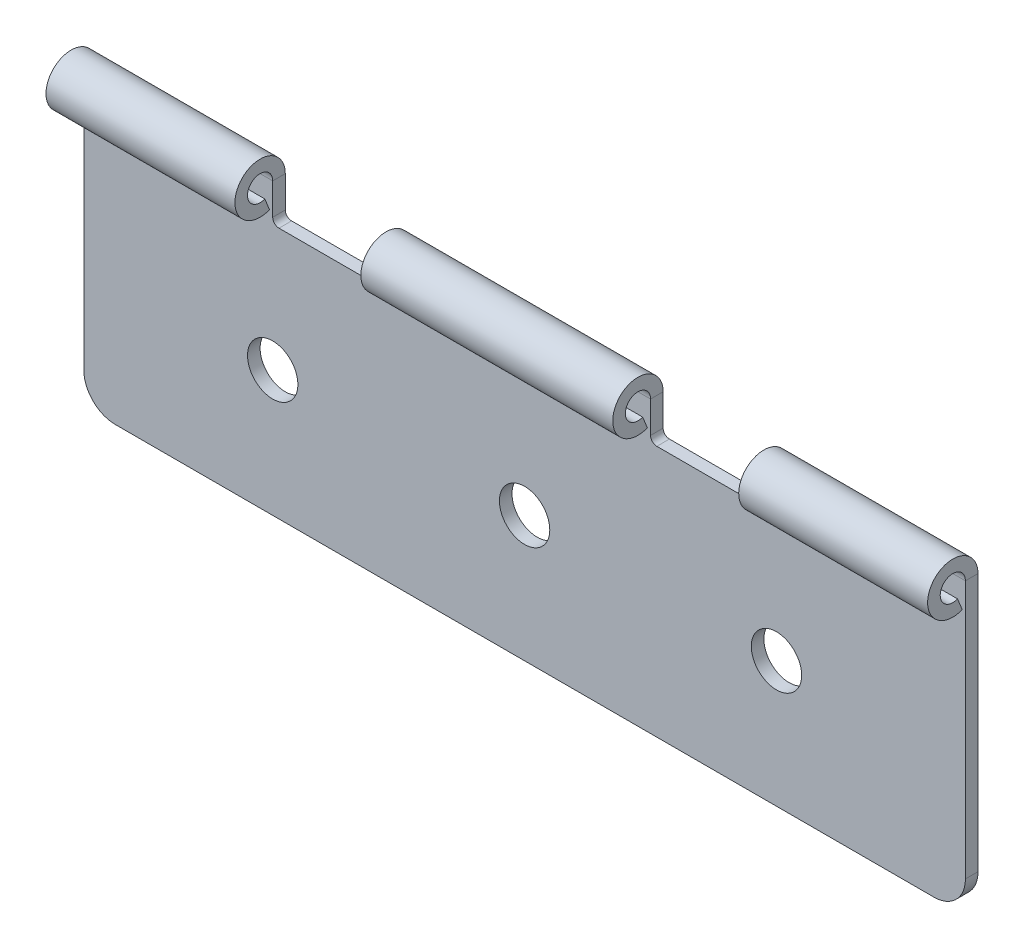
ISO-10303-21;
HEADER;
FILE_DESCRIPTION(('STEP AP214'),'2;1');
FILE_NAME('part.step','',(''),(''),'','','');
FILE_SCHEMA(('AUTOMOTIVE_DESIGN { 1 0 10303 214 1 1 1 1 }'));
ENDSEC;
DATA;
#1=APPLICATION_CONTEXT('core data for automotive mechanical design processes');
#2=APPLICATION_PROTOCOL_DEFINITION('international standard','automotive_design',2000,#1);
#3=PRODUCT_CONTEXT('',#1,'mechanical');
#4=PRODUCT('Part','Part','',(#3));
#5=PRODUCT_RELATED_PRODUCT_CATEGORY('part','',(#4));
#6=PRODUCT_DEFINITION_FORMATION('','',#4);
#7=PRODUCT_DEFINITION_CONTEXT('part definition',#1,'design');
#8=PRODUCT_DEFINITION('design','',#6,#7);
#9=PRODUCT_DEFINITION_SHAPE('','',#8);
#10=(LENGTH_UNIT() NAMED_UNIT(*) SI_UNIT(.MILLI.,.METRE.));
#11=(NAMED_UNIT(*) PLANE_ANGLE_UNIT() SI_UNIT($,.RADIAN.));
#12=(NAMED_UNIT(*) SI_UNIT($,.STERADIAN.) SOLID_ANGLE_UNIT());
#13=UNCERTAINTY_MEASURE_WITH_UNIT(LENGTH_MEASURE(1.E-05),#10,'distance_accuracy_value','');
#14=(GEOMETRIC_REPRESENTATION_CONTEXT(3) GLOBAL_UNCERTAINTY_ASSIGNED_CONTEXT((#13)) GLOBAL_UNIT_ASSIGNED_CONTEXT((#10,
#11,#12)) REPRESENTATION_CONTEXT('',''));
#15=CARTESIAN_POINT('',(0.,0.,0.));
#16=DIRECTION('',(0.,0.,1.));
#17=DIRECTION('',(1.,0.,0.));
#18=AXIS2_PLACEMENT_3D('',#15,#16,#17);
#19=CARTESIAN_POINT('',(110.,40.,-2.));
#20=DIRECTION('',(-1.,0.,0.));
#21=DIRECTION('',(0.,0.,1.));
#22=AXIS2_PLACEMENT_3D('',#19,#20,#21);
#23=PLANE('',#22);
#24=DIRECTION('',(0.,-1.,0.));
#25=VECTOR('',#24,1.);
#26=CARTESIAN_POINT('',(110.,40.,-2.));
#27=LINE('',#26,#25);
#28=CARTESIAN_POINT('',(110.,46.,-2.00000000000001));
#29=VERTEX_POINT('',#28);
#30=CARTESIAN_POINT('',(110.,41.,-2.));
#31=VERTEX_POINT('',#30);
#32=EDGE_CURVE('E206',#29,#31,#27,.T.);
#33=ORIENTED_EDGE('',*,*,#32,.T.);
#34=DIRECTION('',(0.,0.,1.));
#35=VECTOR('',#34,1.);
#36=CARTESIAN_POINT('',(110.,41.,0.));
#37=LINE('',#36,#35);
#38=CARTESIAN_POINT('',(110.,41.,0.));
#39=VERTEX_POINT('',#38);
#40=EDGE_CURVE('E341',#31,#39,#37,.T.);
#41=ORIENTED_EDGE('',*,*,#40,.T.);
#42=DIRECTION('',(0.,-1.,0.));
#43=VECTOR('',#42,1.);
#44=CARTESIAN_POINT('',(110.,40.,0.));
#45=LINE('',#44,#43);
#46=CARTESIAN_POINT('',(110.,46.,0.));
#47=VERTEX_POINT('',#46);
#48=EDGE_CURVE('E346',#47,#39,#45,.T.);
#49=ORIENTED_EDGE('',*,*,#48,.F.);
#50=DIRECTION('',(0.,0.,-1.));
#51=VECTOR('',#50,1.);
#52=CARTESIAN_POINT('',(110.,46.,0.));
#53=LINE('',#52,#51);
#54=EDGE_CURVE('E218',#47,#29,#53,.T.);
#55=ORIENTED_EDGE('',*,*,#54,.T.);
#56=EDGE_LOOP('',(#33,#41,#49,#55));
#57=FACE_BOUND('',#56,.T.);
#58=ADVANCED_FACE('F38',(#57),#23,.T.);
#59=CARTESIAN_POINT('',(50.,40.,-2.));
#60=DIRECTION('',(-1.,0.,0.));
#61=DIRECTION('',(0.,-1.,0.));
#62=AXIS2_PLACEMENT_3D('',#59,#60,#61);
#63=PLANE('',#62);
#64=DIRECTION('',(0.,-1.,0.));
#65=VECTOR('',#64,1.);
#66=CARTESIAN_POINT('',(50.,40.,-2.));
#67=LINE('',#66,#65);
#68=CARTESIAN_POINT('',(50.,46.,-2.));
#69=VERTEX_POINT('',#68);
#70=CARTESIAN_POINT('',(50.,41.,-2.));
#71=VERTEX_POINT('',#70);
#72=EDGE_CURVE('E331',#69,#71,#67,.T.);
#73=ORIENTED_EDGE('',*,*,#72,.T.);
#74=DIRECTION('',(0.,0.,1.));
#75=VECTOR('',#74,1.);
#76=CARTESIAN_POINT('',(50.,41.,0.));
#77=LINE('',#76,#75);
#78=CARTESIAN_POINT('',(50.,41.,0.));
#79=VERTEX_POINT('',#78);
#80=EDGE_CURVE('E373',#71,#79,#77,.T.);
#81=ORIENTED_EDGE('',*,*,#80,.T.);
#82=DIRECTION('',(0.,-1.,0.));
#83=VECTOR('',#82,1.);
#84=CARTESIAN_POINT('',(50.,40.,0.));
#85=LINE('',#84,#83);
#86=CARTESIAN_POINT('',(50.,46.,0.));
#87=VERTEX_POINT('',#86);
#88=EDGE_CURVE('E354',#87,#79,#85,.T.);
#89=ORIENTED_EDGE('',*,*,#88,.F.);
#90=DIRECTION('',(0.,0.,-1.));
#91=VECTOR('',#90,1.);
#92=CARTESIAN_POINT('',(50.,46.,0.));
#93=LINE('',#92,#91);
#94=EDGE_CURVE('E263',#87,#69,#93,.T.);
#95=ORIENTED_EDGE('',*,*,#94,.T.);
#96=EDGE_LOOP('',(#73,#81,#89,#95));
#97=FACE_BOUND('',#96,.T.);
#98=ADVANCED_FACE('F456',(#97),#63,.T.);
#99=CARTESIAN_POINT('',(0.,0.,-2.));
#100=DIRECTION('',(-1.,0.,0.));
#101=DIRECTION('',(0.,0.,1.));
#102=AXIS2_PLACEMENT_3D('',#99,#100,#101);
#103=PLANE('',#102);
#104=DIRECTION('',(0.,-1.,0.));
#105=VECTOR('',#104,1.);
#106=CARTESIAN_POINT('',(0.,0.,-2.));
#107=LINE('',#106,#105);
#108=CARTESIAN_POINT('',(0.,46.,-2.00000000000001));
#109=VERTEX_POINT('',#108);
#110=CARTESIAN_POINT('',(0.,5.,-2.));
#111=VERTEX_POINT('',#110);
#112=EDGE_CURVE('E339',#109,#111,#107,.T.);
#113=ORIENTED_EDGE('',*,*,#112,.T.);
#114=DIRECTION('',(0.,0.,1.));
#115=VECTOR('',#114,1.);
#116=CARTESIAN_POINT('',(0.,5.,-2.));
#117=LINE('',#116,#115);
#118=CARTESIAN_POINT('',(0.,5.,0.));
#119=VERTEX_POINT('',#118);
#120=EDGE_CURVE('E11',#111,#119,#117,.T.);
#121=ORIENTED_EDGE('',*,*,#120,.T.);
#122=DIRECTION('',(0.,-1.,0.));
#123=VECTOR('',#122,1.);
#124=CARTESIAN_POINT('',(0.,0.,0.));
#125=LINE('',#124,#123);
#126=CARTESIAN_POINT('',(0.,46.,0.));
#127=VERTEX_POINT('',#126);
#128=EDGE_CURVE('E323',#127,#119,#125,.T.);
#129=ORIENTED_EDGE('',*,*,#128,.F.);
#130=DIRECTION('',(0.,0.,-1.));
#131=VECTOR('',#130,1.);
#132=CARTESIAN_POINT('',(0.,46.,0.));
#133=LINE('',#132,#131);
#134=EDGE_CURVE('E296',#127,#109,#133,.T.);
#135=ORIENTED_EDGE('',*,*,#134,.T.);
#136=EDGE_LOOP('',(#113,#121,#129,#135));
#137=FACE_BOUND('',#136,.T.);
#138=ADVANCED_FACE('F423',(#137),#103,.T.);
#139=CARTESIAN_POINT('',(140.,0.,-2.));
#140=DIRECTION('',(0.,-1.,0.));
#141=DIRECTION('',(1.,0.,0.));
#142=AXIS2_PLACEMENT_3D('',#139,#140,#141);
#143=PLANE('',#142);
#144=DIRECTION('',(1.,0.,0.));
#145=VECTOR('',#144,1.);
#146=CARTESIAN_POINT('',(140.,0.,-2.));
#147=LINE('',#146,#145);
#148=CARTESIAN_POINT('',(5.,0.,-2.));
#149=VERTEX_POINT('',#148);
#150=CARTESIAN_POINT('',(135.,0.,-2.));
#151=VERTEX_POINT('',#150);
#152=EDGE_CURVE('E207',#149,#151,#147,.T.);
#153=ORIENTED_EDGE('',*,*,#152,.T.);
#154=DIRECTION('',(0.,0.,1.));
#155=VECTOR('',#154,1.);
#156=CARTESIAN_POINT('',(135.,0.,-2.));
#157=LINE('',#156,#155);
#158=CARTESIAN_POINT('',(135.,0.,0.));
#159=VERTEX_POINT('',#158);
#160=EDGE_CURVE('E401',#151,#159,#157,.T.);
#161=ORIENTED_EDGE('',*,*,#160,.T.);
#162=DIRECTION('',(1.,0.,0.));
#163=VECTOR('',#162,1.);
#164=CARTESIAN_POINT('',(140.,0.,0.));
#165=LINE('',#164,#163);
#166=CARTESIAN_POINT('',(5.,0.,0.));
#167=VERTEX_POINT('',#166);
#168=EDGE_CURVE('E319',#167,#159,#165,.T.);
#169=ORIENTED_EDGE('',*,*,#168,.F.);
#170=DIRECTION('',(0.,0.,1.));
#171=VECTOR('',#170,1.);
#172=CARTESIAN_POINT('',(5.,0.,-2.));
#173=LINE('',#172,#171);
#174=EDGE_CURVE('E399',#167,#149,#173,.F.);
#175=ORIENTED_EDGE('',*,*,#174,.T.);
#176=EDGE_LOOP('',(#153,#161,#169,#175));
#177=FACE_BOUND('',#176,.T.);
#178=ADVANCED_FACE('F412',(#177),#143,.T.);
#179=CARTESIAN_POINT('',(30.,50.,-2.));
#180=DIRECTION('',(1.,0.,0.));
#181=DIRECTION('',(0.,1.,0.));
#182=AXIS2_PLACEMENT_3D('',#179,#180,#181);
#183=PLANE('',#182);
#184=DIRECTION('',(0.,1.,0.));
#185=VECTOR('',#184,1.);
#186=CARTESIAN_POINT('',(30.,50.,0.));
#187=LINE('',#186,#185);
#188=CARTESIAN_POINT('',(30.,41.,0.));
#189=VERTEX_POINT('',#188);
#190=CARTESIAN_POINT('',(30.,46.,0.));
#191=VERTEX_POINT('',#190);
#192=EDGE_CURVE('E360',#189,#191,#187,.T.);
#193=ORIENTED_EDGE('',*,*,#192,.F.);
#194=DIRECTION('',(0.,0.,1.));
#195=VECTOR('',#194,1.);
#196=CARTESIAN_POINT('',(30.,41.,-2.));
#197=LINE('',#196,#195);
#198=CARTESIAN_POINT('',(30.,41.,-2.));
#199=VERTEX_POINT('',#198);
#200=EDGE_CURVE('E381',#189,#199,#197,.F.);
#201=ORIENTED_EDGE('',*,*,#200,.T.);
#202=DIRECTION('',(0.,1.,0.));
#203=VECTOR('',#202,1.);
#204=CARTESIAN_POINT('',(30.,50.,-2.));
#205=LINE('',#204,#203);
#206=CARTESIAN_POINT('',(30.,46.,-2.));
#207=VERTEX_POINT('',#206);
#208=EDGE_CURVE('E337',#199,#207,#205,.T.);
#209=ORIENTED_EDGE('',*,*,#208,.T.);
#210=DIRECTION('',(0.,0.,-1.));
#211=VECTOR('',#210,1.);
#212=CARTESIAN_POINT('',(30.,46.,0.));
#213=LINE('',#212,#211);
#214=EDGE_CURVE('E312',#191,#207,#213,.T.);
#215=ORIENTED_EDGE('',*,*,#214,.F.);
#216=EDGE_LOOP('',(#193,#201,#209,#215));
#217=FACE_BOUND('',#216,.T.);
#218=ADVANCED_FACE('F437',(#217),#183,.T.);
#219=CARTESIAN_POINT('',(30.,40.,-2.));
#220=DIRECTION('',(0.,1.,0.));
#221=DIRECTION('',(0.,0.,1.));
#222=AXIS2_PLACEMENT_3D('',#219,#220,#221);
#223=PLANE('',#222);
#224=DIRECTION('',(-1.,0.,0.));
#225=VECTOR('',#224,1.);
#226=CARTESIAN_POINT('',(30.,40.,0.));
#227=LINE('',#226,#225);
#228=CARTESIAN_POINT('',(49.,40.,0.));
#229=VERTEX_POINT('',#228);
#230=CARTESIAN_POINT('',(31.,40.,0.));
#231=VERTEX_POINT('',#230);
#232=EDGE_CURVE('E357',#229,#231,#227,.T.);
#233=ORIENTED_EDGE('',*,*,#232,.F.);
#234=DIRECTION('',(0.,0.,1.));
#235=VECTOR('',#234,1.);
#236=CARTESIAN_POINT('',(49.,40.,-2.));
#237=LINE('',#236,#235);
#238=CARTESIAN_POINT('',(49.,40.,-2.));
#239=VERTEX_POINT('',#238);
#240=EDGE_CURVE('E379',#229,#239,#237,.F.);
#241=ORIENTED_EDGE('',*,*,#240,.T.);
#242=DIRECTION('',(-1.,0.,0.));
#243=VECTOR('',#242,1.);
#244=CARTESIAN_POINT('',(30.,40.,-2.));
#245=LINE('',#244,#243);
#246=CARTESIAN_POINT('',(31.,40.,-2.));
#247=VERTEX_POINT('',#246);
#248=EDGE_CURVE('E334',#239,#247,#245,.T.);
#249=ORIENTED_EDGE('',*,*,#248,.T.);
#250=DIRECTION('',(0.,0.,1.));
#251=VECTOR('',#250,1.);
#252=CARTESIAN_POINT('',(31.,40.,0.));
#253=LINE('',#252,#251);
#254=EDGE_CURVE('E376',#247,#231,#253,.T.);
#255=ORIENTED_EDGE('',*,*,#254,.T.);
#256=EDGE_LOOP('',(#233,#241,#249,#255));
#257=FACE_BOUND('',#256,.T.);
#258=ADVANCED_FACE('F447',(#257),#223,.T.);
#259=CARTESIAN_POINT('',(90.,50.,-2.));
#260=DIRECTION('',(1.,0.,0.));
#261=DIRECTION('',(0.,1.,0.));
#262=AXIS2_PLACEMENT_3D('',#259,#260,#261);
#263=PLANE('',#262);
#264=DIRECTION('',(0.,1.,0.));
#265=VECTOR('',#264,1.);
#266=CARTESIAN_POINT('',(90.,50.,0.));
#267=LINE('',#266,#265);
#268=CARTESIAN_POINT('',(90.,41.,0.));
#269=VERTEX_POINT('',#268);
#270=CARTESIAN_POINT('',(90.,46.,0.));
#271=VERTEX_POINT('',#270);
#272=EDGE_CURVE('E352',#269,#271,#267,.T.);
#273=ORIENTED_EDGE('',*,*,#272,.F.);
#274=DIRECTION('',(0.,0.,1.));
#275=VECTOR('',#274,1.);
#276=CARTESIAN_POINT('',(90.,41.,-2.));
#277=LINE('',#276,#275);
#278=CARTESIAN_POINT('',(90.,41.,-2.));
#279=VERTEX_POINT('',#278);
#280=EDGE_CURVE('E371',#269,#279,#277,.F.);
#281=ORIENTED_EDGE('',*,*,#280,.T.);
#282=DIRECTION('',(0.,1.,0.));
#283=VECTOR('',#282,1.);
#284=CARTESIAN_POINT('',(90.,50.,-2.));
#285=LINE('',#284,#283);
#286=CARTESIAN_POINT('',(90.,46.,-2.));
#287=VERTEX_POINT('',#286);
#288=EDGE_CURVE('E329',#279,#287,#285,.T.);
#289=ORIENTED_EDGE('',*,*,#288,.T.);
#290=DIRECTION('',(0.,0.,-1.));
#291=VECTOR('',#290,1.);
#292=CARTESIAN_POINT('',(90.,46.,0.));
#293=LINE('',#292,#291);
#294=EDGE_CURVE('E279',#271,#287,#293,.T.);
#295=ORIENTED_EDGE('',*,*,#294,.F.);
#296=EDGE_LOOP('',(#273,#281,#289,#295));
#297=FACE_BOUND('',#296,.T.);
#298=ADVANCED_FACE('F480',(#297),#263,.T.);
#299=CARTESIAN_POINT('',(90.,40.,-2.));
#300=DIRECTION('',(0.,1.,0.));
#301=DIRECTION('',(0.,0.,1.));
#302=AXIS2_PLACEMENT_3D('',#299,#300,#301);
#303=PLANE('',#302);
#304=DIRECTION('',(-1.,0.,0.));
#305=VECTOR('',#304,1.);
#306=CARTESIAN_POINT('',(90.,40.,0.));
#307=LINE('',#306,#305);
#308=CARTESIAN_POINT('',(109.,40.,0.));
#309=VERTEX_POINT('',#308);
#310=CARTESIAN_POINT('',(91.,40.,0.));
#311=VERTEX_POINT('',#310);
#312=EDGE_CURVE('E349',#309,#311,#307,.T.);
#313=ORIENTED_EDGE('',*,*,#312,.F.);
#314=DIRECTION('',(0.,0.,1.));
#315=VECTOR('',#314,1.);
#316=CARTESIAN_POINT('',(109.,40.,-2.));
#317=LINE('',#316,#315);
#318=CARTESIAN_POINT('',(109.,40.,-2.));
#319=VERTEX_POINT('',#318);
#320=EDGE_CURVE('E369',#309,#319,#317,.F.);
#321=ORIENTED_EDGE('',*,*,#320,.T.);
#322=DIRECTION('',(-1.,0.,0.));
#323=VECTOR('',#322,1.);
#324=CARTESIAN_POINT('',(90.,40.,-2.));
#325=LINE('',#324,#323);
#326=CARTESIAN_POINT('',(91.,40.,-2.));
#327=VERTEX_POINT('',#326);
#328=EDGE_CURVE('E326',#319,#327,#325,.T.);
#329=ORIENTED_EDGE('',*,*,#328,.T.);
#330=DIRECTION('',(0.,0.,1.));
#331=VECTOR('',#330,1.);
#332=CARTESIAN_POINT('',(91.,40.,0.));
#333=LINE('',#332,#331);
#334=EDGE_CURVE('E366',#327,#311,#333,.T.);
#335=ORIENTED_EDGE('',*,*,#334,.T.);
#336=EDGE_LOOP('',(#313,#321,#329,#335));
#337=FACE_BOUND('',#336,.T.);
#338=ADVANCED_FACE('F489',(#337),#303,.T.);
#339=CARTESIAN_POINT('',(140.,50.,-2.));
#340=DIRECTION('',(1.,0.,0.));
#341=DIRECTION('',(0.,0.,-1.));
#342=AXIS2_PLACEMENT_3D('',#339,#340,#341);
#343=PLANE('',#342);
#344=DIRECTION('',(0.,1.,0.));
#345=VECTOR('',#344,1.);
#346=CARTESIAN_POINT('',(140.,50.,0.));
#347=LINE('',#346,#345);
#348=CARTESIAN_POINT('',(140.,5.,0.));
#349=VERTEX_POINT('',#348);
#350=CARTESIAN_POINT('',(140.,46.,0.));
#351=VERTEX_POINT('',#350);
#352=EDGE_CURVE('E344',#349,#351,#347,.T.);
#353=ORIENTED_EDGE('',*,*,#352,.F.);
#354=DIRECTION('',(0.,0.,1.));
#355=VECTOR('',#354,1.);
#356=CARTESIAN_POINT('',(140.,5.,-2.));
#357=LINE('',#356,#355);
#358=CARTESIAN_POINT('',(140.,5.,-2.));
#359=VERTEX_POINT('',#358);
#360=EDGE_CURVE('E61',#349,#359,#357,.F.);
#361=ORIENTED_EDGE('',*,*,#360,.T.);
#362=DIRECTION('',(0.,1.,0.));
#363=VECTOR('',#362,1.);
#364=CARTESIAN_POINT('',(140.,50.,-2.));
#365=LINE('',#364,#363);
#366=CARTESIAN_POINT('',(140.,46.,-2.));
#367=VERTEX_POINT('',#366);
#368=EDGE_CURVE('E200',#359,#367,#365,.T.);
#369=ORIENTED_EDGE('',*,*,#368,.T.);
#370=DIRECTION('',(0.,0.,-1.));
#371=VECTOR('',#370,1.);
#372=CARTESIAN_POINT('',(140.,46.,0.));
#373=LINE('',#372,#371);
#374=EDGE_CURVE('E203',#351,#367,#373,.T.);
#375=ORIENTED_EDGE('',*,*,#374,.F.);
#376=EDGE_LOOP('',(#353,#361,#369,#375));
#377=FACE_BOUND('',#376,.T.);
#378=ADVANCED_FACE('F202',(#377),#343,.T.);
#379=CARTESIAN_POINT('',(0.,0.,-2.));
#380=DIRECTION('',(0.,0.,-1.));
#381=DIRECTION('',(-1.,0.,0.));
#382=AXIS2_PLACEMENT_3D('',#379,#380,#381);
#383=PLANE('',#382);
#384=CARTESIAN_POINT('',(110.,20.,-2.));
#385=DIRECTION('',(0.,0.,-1.));
#386=DIRECTION('',(-1.,0.,0.));
#387=AXIS2_PLACEMENT_3D('',#384,#385,#386);
#388=CIRCLE('',#387,4.00000000000001);
#389=CARTESIAN_POINT('',(106.,20.,-2.));
#390=VERTEX_POINT('',#389);
#391=EDGE_CURVE('E886',#390,#390,#388,.T.);
#392=ORIENTED_EDGE('',*,*,#391,.F.);
#393=EDGE_LOOP('',(#392));
#394=FACE_BOUND('',#393,.T.);
#395=CARTESIAN_POINT('',(30.,20.,-2.));
#396=DIRECTION('',(0.,0.,-1.));
#397=DIRECTION('',(-1.,0.,0.));
#398=AXIS2_PLACEMENT_3D('',#395,#396,#397);
#399=CIRCLE('',#398,4.);
#400=CARTESIAN_POINT('',(26.,20.,-2.));
#401=VERTEX_POINT('',#400);
#402=EDGE_CURVE('E880',#401,#401,#399,.T.);
#403=ORIENTED_EDGE('',*,*,#402,.F.);
#404=EDGE_LOOP('',(#403));
#405=FACE_BOUND('',#404,.T.);
#406=CARTESIAN_POINT('',(70.,20.,-2.00000000000001));
#407=DIRECTION('',(0.,0.,1.));
#408=DIRECTION('',(1.,0.,0.));
#409=AXIS2_PLACEMENT_3D('',#406,#407,#408);
#410=CIRCLE('',#409,4.00000000000001);
#411=CARTESIAN_POINT('',(74.,20.,-2.00000000000001));
#412=VERTEX_POINT('',#411);
#413=EDGE_CURVE('E248',#412,#412,#410,.T.);
#414=ORIENTED_EDGE('',*,*,#413,.T.);
#415=EDGE_LOOP('',(#414));
#416=FACE_BOUND('',#415,.T.);
#417=ORIENTED_EDGE('',*,*,#368,.F.);
#418=CARTESIAN_POINT('',(135.,5.,-2.));
#419=DIRECTION('',(0.,0.,-1.));
#420=DIRECTION('',(-1.,0.,0.));
#421=AXIS2_PLACEMENT_3D('',#418,#419,#420);
#422=CIRCLE('',#421,5.);
#423=EDGE_CURVE('E46',#359,#151,#422,.T.);
#424=ORIENTED_EDGE('',*,*,#423,.T.);
#425=ORIENTED_EDGE('',*,*,#152,.F.);
#426=CARTESIAN_POINT('',(5.,5.,-2.));
#427=DIRECTION('',(0.,0.,-1.));
#428=DIRECTION('',(-1.,0.,0.));
#429=AXIS2_PLACEMENT_3D('',#426,#427,#428);
#430=CIRCLE('',#429,5.);
#431=EDGE_CURVE('E53',#149,#111,#430,.T.);
#432=ORIENTED_EDGE('',*,*,#431,.T.);
#433=ORIENTED_EDGE('',*,*,#112,.F.);
#434=DIRECTION('',(-1.,0.,0.));
#435=VECTOR('',#434,1.);
#436=CARTESIAN_POINT('',(0.,46.,-2.00000000000001));
#437=LINE('',#436,#435);
#438=EDGE_CURVE('E289',#109,#207,#437,.F.);
#439=ORIENTED_EDGE('',*,*,#438,.T.);
#440=ORIENTED_EDGE('',*,*,#208,.F.);
#441=CARTESIAN_POINT('',(31.,41.,-2.));
#442=DIRECTION('',(0.,0.,-1.));
#443=DIRECTION('',(-1.,0.,0.));
#444=AXIS2_PLACEMENT_3D('',#441,#442,#443);
#445=CIRCLE('',#444,1.);
#446=EDGE_CURVE('E397',#199,#247,#445,.F.);
#447=ORIENTED_EDGE('',*,*,#446,.T.);
#448=ORIENTED_EDGE('',*,*,#248,.F.);
#449=CARTESIAN_POINT('',(49.,41.,-2.));
#450=DIRECTION('',(0.,0.,-1.));
#451=DIRECTION('',(-1.,0.,0.));
#452=AXIS2_PLACEMENT_3D('',#449,#450,#451);
#453=CIRCLE('',#452,1.);
#454=EDGE_CURVE('E393',#239,#71,#453,.F.);
#455=ORIENTED_EDGE('',*,*,#454,.T.);
#456=ORIENTED_EDGE('',*,*,#72,.F.);
#457=DIRECTION('',(-1.,0.,0.));
#458=VECTOR('',#457,1.);
#459=CARTESIAN_POINT('',(50.,46.,-2.));
#460=LINE('',#459,#458);
#461=EDGE_CURVE('E256',#69,#287,#460,.F.);
#462=ORIENTED_EDGE('',*,*,#461,.T.);
#463=ORIENTED_EDGE('',*,*,#288,.F.);
#464=CARTESIAN_POINT('',(91.,41.,-2.));
#465=DIRECTION('',(0.,0.,-1.));
#466=DIRECTION('',(-1.,0.,0.));
#467=AXIS2_PLACEMENT_3D('',#464,#465,#466);
#468=CIRCLE('',#467,1.);
#469=EDGE_CURVE('E389',#279,#327,#468,.F.);
#470=ORIENTED_EDGE('',*,*,#469,.T.);
#471=ORIENTED_EDGE('',*,*,#328,.F.);
#472=CARTESIAN_POINT('',(109.,41.,-2.));
#473=DIRECTION('',(0.,0.,-1.));
#474=DIRECTION('',(-1.,0.,0.));
#475=AXIS2_PLACEMENT_3D('',#472,#473,#474);
#476=CIRCLE('',#475,1.);
#477=EDGE_CURVE('E385',#319,#31,#476,.F.);
#478=ORIENTED_EDGE('',*,*,#477,.T.);
#479=ORIENTED_EDGE('',*,*,#32,.F.);
#480=DIRECTION('',(-1.,0.,0.));
#481=VECTOR('',#480,1.);
#482=CARTESIAN_POINT('',(110.,46.,-2.00000000000001));
#483=LINE('',#482,#481);
#484=EDGE_CURVE('E224',#29,#367,#483,.F.);
#485=ORIENTED_EDGE('',*,*,#484,.T.);
#486=EDGE_LOOP('',(#417,#424,#425,#432,#433,#439,#440,#447,#448,#455,#456,#462,#463,#470,#471,
#478,#479,#485));
#487=FACE_BOUND('',#486,.T.);
#488=ADVANCED_FACE('F230',(#394,#405,#416,#487),#383,.T.);
#489=CARTESIAN_POINT('',(0.,0.,0.));
#490=DIRECTION('',(0.,0.,-1.));
#491=DIRECTION('',(-1.,0.,0.));
#492=AXIS2_PLACEMENT_3D('',#489,#490,#491);
#493=PLANE('',#492);
#494=CARTESIAN_POINT('',(110.,20.,0.));
#495=DIRECTION('',(0.,0.,1.));
#496=DIRECTION('',(1.,0.,0.));
#497=AXIS2_PLACEMENT_3D('',#494,#495,#496);
#498=CIRCLE('',#497,4.00000000000001);
#499=CARTESIAN_POINT('',(114.,20.,0.));
#500=VERTEX_POINT('',#499);
#501=EDGE_CURVE('E891',#500,#500,#498,.T.);
#502=ORIENTED_EDGE('',*,*,#501,.F.);
#503=EDGE_LOOP('',(#502));
#504=FACE_BOUND('',#503,.T.);
#505=CARTESIAN_POINT('',(30.,20.,0.));
#506=DIRECTION('',(0.,0.,1.));
#507=DIRECTION('',(1.,0.,0.));
#508=AXIS2_PLACEMENT_3D('',#505,#506,#507);
#509=CIRCLE('',#508,4.);
#510=CARTESIAN_POINT('',(34.,20.,0.));
#511=VERTEX_POINT('',#510);
#512=EDGE_CURVE('E882',#511,#511,#509,.T.);
#513=ORIENTED_EDGE('',*,*,#512,.F.);
#514=EDGE_LOOP('',(#513));
#515=FACE_BOUND('',#514,.T.);
#516=CARTESIAN_POINT('',(70.,20.,0.));
#517=DIRECTION('',(0.,0.,1.));
#518=DIRECTION('',(1.,0.,0.));
#519=AXIS2_PLACEMENT_3D('',#516,#517,#518);
#520=CIRCLE('',#519,4.00000000000001);
#521=CARTESIAN_POINT('',(74.,20.,0.));
#522=VERTEX_POINT('',#521);
#523=EDGE_CURVE('E236',#522,#522,#520,.T.);
#524=ORIENTED_EDGE('',*,*,#523,.F.);
#525=EDGE_LOOP('',(#524));
#526=FACE_BOUND('',#525,.T.);
#527=ORIENTED_EDGE('',*,*,#168,.T.);
#528=CARTESIAN_POINT('',(135.,5.,0.));
#529=DIRECTION('',(0.,0.,-1.));
#530=DIRECTION('',(-1.,0.,0.));
#531=AXIS2_PLACEMENT_3D('',#528,#529,#530);
#532=CIRCLE('',#531,5.);
#533=EDGE_CURVE('E406',#159,#349,#532,.F.);
#534=ORIENTED_EDGE('',*,*,#533,.T.);
#535=ORIENTED_EDGE('',*,*,#352,.T.);
#536=DIRECTION('',(-1.,0.,0.));
#537=VECTOR('',#536,1.);
#538=CARTESIAN_POINT('',(110.,46.,0.));
#539=LINE('',#538,#537);
#540=EDGE_CURVE('E241',#47,#351,#539,.F.);
#541=ORIENTED_EDGE('',*,*,#540,.F.);
#542=ORIENTED_EDGE('',*,*,#48,.T.);
#543=CARTESIAN_POINT('',(109.,41.,0.));
#544=DIRECTION('',(0.,0.,-1.));
#545=DIRECTION('',(-1.,0.,0.));
#546=AXIS2_PLACEMENT_3D('',#543,#544,#545);
#547=CIRCLE('',#546,1.);
#548=EDGE_CURVE('E383',#39,#309,#547,.T.);
#549=ORIENTED_EDGE('',*,*,#548,.T.);
#550=ORIENTED_EDGE('',*,*,#312,.T.);
#551=CARTESIAN_POINT('',(91.,41.,0.));
#552=DIRECTION('',(0.,0.,-1.));
#553=DIRECTION('',(-1.,0.,0.));
#554=AXIS2_PLACEMENT_3D('',#551,#552,#553);
#555=CIRCLE('',#554,1.);
#556=EDGE_CURVE('E387',#311,#269,#555,.T.);
#557=ORIENTED_EDGE('',*,*,#556,.T.);
#558=ORIENTED_EDGE('',*,*,#272,.T.);
#559=DIRECTION('',(-1.,0.,0.));
#560=VECTOR('',#559,1.);
#561=CARTESIAN_POINT('',(50.,46.,0.));
#562=LINE('',#561,#560);
#563=EDGE_CURVE('E272',#87,#271,#562,.F.);
#564=ORIENTED_EDGE('',*,*,#563,.F.);
#565=ORIENTED_EDGE('',*,*,#88,.T.);
#566=CARTESIAN_POINT('',(49.,41.,0.));
#567=DIRECTION('',(0.,0.,-1.));
#568=DIRECTION('',(-1.,0.,0.));
#569=AXIS2_PLACEMENT_3D('',#566,#567,#568);
#570=CIRCLE('',#569,1.);
#571=EDGE_CURVE('E391',#79,#229,#570,.T.);
#572=ORIENTED_EDGE('',*,*,#571,.T.);
#573=ORIENTED_EDGE('',*,*,#232,.T.);
#574=CARTESIAN_POINT('',(31.,41.,0.));
#575=DIRECTION('',(0.,0.,-1.));
#576=DIRECTION('',(-1.,0.,0.));
#577=AXIS2_PLACEMENT_3D('',#574,#575,#576);
#578=CIRCLE('',#577,1.);
#579=EDGE_CURVE('E395',#231,#189,#578,.T.);
#580=ORIENTED_EDGE('',*,*,#579,.T.);
#581=ORIENTED_EDGE('',*,*,#192,.T.);
#582=DIRECTION('',(-1.,0.,0.));
#583=VECTOR('',#582,1.);
#584=CARTESIAN_POINT('',(0.,46.,0.));
#585=LINE('',#584,#583);
#586=EDGE_CURVE('E305',#127,#191,#585,.F.);
#587=ORIENTED_EDGE('',*,*,#586,.F.);
#588=ORIENTED_EDGE('',*,*,#128,.T.);
#589=CARTESIAN_POINT('',(5.,5.,0.));
#590=DIRECTION('',(0.,0.,-1.));
#591=DIRECTION('',(-1.,0.,0.));
#592=AXIS2_PLACEMENT_3D('',#589,#590,#591);
#593=CIRCLE('',#592,5.);
#594=EDGE_CURVE('E404',#119,#167,#593,.F.);
#595=ORIENTED_EDGE('',*,*,#594,.T.);
#596=EDGE_LOOP('',(#527,#534,#535,#541,#542,#549,#550,#557,#558,#564,#565,#572,#573,#580,#581,
#587,#588,#595));
#597=FACE_BOUND('',#596,.T.);
#598=ADVANCED_FACE('F417',(#504,#515,#526,#597),#493,.F.);
#599=CARTESIAN_POINT('',(15.,44.1456322908664,1.25078681316815));
#600=DIRECTION('',(0.,-0.374606593415923,0.927183854566783));
#601=DIRECTION('',(-1.,0.,0.));
#602=AXIS2_PLACEMENT_3D('',#599,#600,#601);
#603=PLANE('',#602);
#604=DIRECTION('',(0.,-0.927183854566783,-0.374606593415923));
#605=VECTOR('',#604,1.);
#606=CARTESIAN_POINT('',(0.,44.1456322908664,1.25078681316815));
#607=LINE('',#606,#605);
#608=CARTESIAN_POINT('',(0.,44.1456322908664,1.25078681316815));
#609=VERTEX_POINT('',#608);
#610=CARTESIAN_POINT('',(0.,42.2912645817329,0.501573626336305));
#611=VERTEX_POINT('',#610);
#612=EDGE_CURVE('E317',#609,#611,#607,.T.);
#613=ORIENTED_EDGE('',*,*,#612,.F.);
#614=DIRECTION('',(-1.,0.,0.));
#615=VECTOR('',#614,1.);
#616=CARTESIAN_POINT('',(0.,44.1456322908664,1.25078681316815));
#617=LINE('',#616,#615);
#618=CARTESIAN_POINT('',(30.,44.1456322908664,1.25078681316815));
#619=VERTEX_POINT('',#618);
#620=EDGE_CURVE('E286',#619,#609,#617,.T.);
#621=ORIENTED_EDGE('',*,*,#620,.F.);
#622=DIRECTION('',(0.,-0.927183854566783,-0.374606593415923));
#623=VECTOR('',#622,1.);
#624=CARTESIAN_POINT('',(30.,44.1456322908664,1.25078681316815));
#625=LINE('',#624,#623);
#626=CARTESIAN_POINT('',(30.,42.2912645817329,0.501573626336308));
#627=VERTEX_POINT('',#626);
#628=EDGE_CURVE('E315',#619,#627,#625,.T.);
#629=ORIENTED_EDGE('',*,*,#628,.T.);
#630=DIRECTION('',(-1.,0.,0.));
#631=VECTOR('',#630,1.);
#632=CARTESIAN_POINT('',(0.,42.2912645817329,0.501573626336305));
#633=LINE('',#632,#631);
#634=EDGE_CURVE('E297',#627,#611,#633,.T.);
#635=ORIENTED_EDGE('',*,*,#634,.T.);
#636=EDGE_LOOP('',(#613,#621,#629,#635));
#637=FACE_BOUND('',#636,.T.);
#638=ADVANCED_FACE('F557',(#637),#603,.F.);
#639=CARTESIAN_POINT('',(30.,46.,2.));
#640=DIRECTION('',(1.,0.,0.));
#641=DIRECTION('',(0.,0.,-1.));
#642=AXIS2_PLACEMENT_3D('',#639,#640,#641);
#643=PLANE('',#642);
#644=ORIENTED_EDGE('',*,*,#628,.F.);
#645=CARTESIAN_POINT('',(30.,46.,2.));
#646=DIRECTION('',(-1.,0.,0.));
#647=DIRECTION('',(0.,0.,1.));
#648=AXIS2_PLACEMENT_3D('',#645,#646,#647);
#649=CIRCLE('',#648,2.);
#650=EDGE_CURVE('E300',#191,#619,#649,.F.);
#651=ORIENTED_EDGE('',*,*,#650,.F.);
#652=ORIENTED_EDGE('',*,*,#214,.T.);
#653=CARTESIAN_POINT('',(30.,46.,2.));
#654=DIRECTION('',(-1.,0.,0.));
#655=DIRECTION('',(0.,0.,1.));
#656=AXIS2_PLACEMENT_3D('',#653,#654,#655);
#657=CIRCLE('',#656,4.);
#658=EDGE_CURVE('E292',#207,#627,#657,.F.);
#659=ORIENTED_EDGE('',*,*,#658,.T.);
#660=EDGE_LOOP('',(#644,#651,#652,#659));
#661=FACE_BOUND('',#660,.T.);
#662=ADVANCED_FACE('F433',(#661),#643,.T.);
#663=CARTESIAN_POINT('',(0.,46.,2.));
#664=DIRECTION('',(1.,0.,0.));
#665=DIRECTION('',(0.,0.,-1.));
#666=AXIS2_PLACEMENT_3D('',#663,#664,#665);
#667=PLANE('',#666);
#668=CARTESIAN_POINT('',(0.,46.,2.));
#669=DIRECTION('',(-1.,0.,0.));
#670=DIRECTION('',(0.,0.,1.));
#671=AXIS2_PLACEMENT_3D('',#668,#669,#670);
#672=CIRCLE('',#671,2.);
#673=EDGE_CURVE('E308',#609,#127,#672,.T.);
#674=ORIENTED_EDGE('',*,*,#673,.F.);
#675=ORIENTED_EDGE('',*,*,#612,.T.);
#676=CARTESIAN_POINT('',(0.,46.,2.));
#677=DIRECTION('',(-1.,0.,0.));
#678=DIRECTION('',(0.,0.,1.));
#679=AXIS2_PLACEMENT_3D('',#676,#677,#678);
#680=CIRCLE('',#679,4.);
#681=EDGE_CURVE('E293',#611,#109,#680,.T.);
#682=ORIENTED_EDGE('',*,*,#681,.T.);
#683=ORIENTED_EDGE('',*,*,#134,.F.);
#684=EDGE_LOOP('',(#674,#675,#682,#683));
#685=FACE_BOUND('',#684,.T.);
#686=ADVANCED_FACE('F796',(#685),#667,.F.);
#687=CARTESIAN_POINT('',(0.,46.,2.));
#688=DIRECTION('',(-1.,0.,0.));
#689=DIRECTION('',(0.,-0.927183854566783,-0.374606593415923));
#690=AXIS2_PLACEMENT_3D('',#687,#688,#689);
#691=CYLINDRICAL_SURFACE('',#690,4.);
#692=ORIENTED_EDGE('',*,*,#438,.F.);
#693=ORIENTED_EDGE('',*,*,#681,.F.);
#694=ORIENTED_EDGE('',*,*,#634,.F.);
#695=ORIENTED_EDGE('',*,*,#658,.F.);
#696=EDGE_LOOP('',(#692,#693,#694,#695));
#697=FACE_BOUND('',#696,.T.);
#698=ADVANCED_FACE('F787',(#697),#691,.T.);
#699=CARTESIAN_POINT('',(0.,46.,2.));
#700=DIRECTION('',(-1.,0.,0.));
#701=DIRECTION('',(0.,-0.927183854566783,-0.374606593415923));
#702=AXIS2_PLACEMENT_3D('',#699,#700,#701);
#703=CYLINDRICAL_SURFACE('',#702,2.);
#704=ORIENTED_EDGE('',*,*,#586,.T.);
#705=ORIENTED_EDGE('',*,*,#650,.T.);
#706=ORIENTED_EDGE('',*,*,#620,.T.);
#707=ORIENTED_EDGE('',*,*,#673,.T.);
#708=EDGE_LOOP('',(#704,#705,#706,#707));
#709=FACE_BOUND('',#708,.T.);
#710=ADVANCED_FACE('F428',(#709),#703,.F.);
#711=CARTESIAN_POINT('',(70.,44.1456322908664,1.25078681316815));
#712=DIRECTION('',(0.,-0.374606593415923,0.927183854566783));
#713=DIRECTION('',(-1.,0.,0.));
#714=AXIS2_PLACEMENT_3D('',#711,#712,#713);
#715=PLANE('',#714);
#716=DIRECTION('',(0.,-0.927183854566783,-0.374606593415923));
#717=VECTOR('',#716,1.);
#718=CARTESIAN_POINT('',(50.,44.1456322908664,1.25078681316815));
#719=LINE('',#718,#717);
#720=CARTESIAN_POINT('',(50.,44.1456322908664,1.25078681316815));
#721=VERTEX_POINT('',#720);
#722=CARTESIAN_POINT('',(50.,42.2912645817329,0.501573626336307));
#723=VERTEX_POINT('',#722);
#724=EDGE_CURVE('E284',#721,#723,#719,.T.);
#725=ORIENTED_EDGE('',*,*,#724,.F.);
#726=DIRECTION('',(-1.,0.,0.));
#727=VECTOR('',#726,1.);
#728=CARTESIAN_POINT('',(50.,44.1456322908664,1.25078681316815));
#729=LINE('',#728,#727);
#730=CARTESIAN_POINT('',(90.,44.1456322908664,1.25078681316815));
#731=VERTEX_POINT('',#730);
#732=EDGE_CURVE('E253',#731,#721,#729,.T.);
#733=ORIENTED_EDGE('',*,*,#732,.F.);
#734=DIRECTION('',(0.,-0.927183854566783,-0.374606593415923));
#735=VECTOR('',#734,1.);
#736=CARTESIAN_POINT('',(90.,44.1456322908664,1.25078681316815));
#737=LINE('',#736,#735);
#738=CARTESIAN_POINT('',(90.,42.2912645817329,0.501573626336307));
#739=VERTEX_POINT('',#738);
#740=EDGE_CURVE('E282',#731,#739,#737,.T.);
#741=ORIENTED_EDGE('',*,*,#740,.T.);
#742=DIRECTION('',(-1.,0.,0.));
#743=VECTOR('',#742,1.);
#744=CARTESIAN_POINT('',(50.,42.2912645817329,0.501573626336307));
#745=LINE('',#744,#743);
#746=EDGE_CURVE('E264',#739,#723,#745,.T.);
#747=ORIENTED_EDGE('',*,*,#746,.T.);
#748=EDGE_LOOP('',(#725,#733,#741,#747));
#749=FACE_BOUND('',#748,.T.);
#750=ADVANCED_FACE('F471',(#749),#715,.F.);
#751=CARTESIAN_POINT('',(90.,46.,2.));
#752=DIRECTION('',(1.,0.,0.));
#753=DIRECTION('',(0.,0.,-1.));
#754=AXIS2_PLACEMENT_3D('',#751,#752,#753);
#755=PLANE('',#754);
#756=ORIENTED_EDGE('',*,*,#740,.F.);
#757=CARTESIAN_POINT('',(90.,46.,2.));
#758=DIRECTION('',(-1.,0.,0.));
#759=DIRECTION('',(0.,0.,1.));
#760=AXIS2_PLACEMENT_3D('',#757,#758,#759);
#761=CIRCLE('',#760,1.99999999999999);
#762=EDGE_CURVE('E267',#271,#731,#761,.F.);
#763=ORIENTED_EDGE('',*,*,#762,.F.);
#764=ORIENTED_EDGE('',*,*,#294,.T.);
#765=CARTESIAN_POINT('',(90.,46.,2.));
#766=DIRECTION('',(-1.,0.,0.));
#767=DIRECTION('',(0.,0.,1.));
#768=AXIS2_PLACEMENT_3D('',#765,#766,#767);
#769=CIRCLE('',#768,3.99999999999999);
#770=EDGE_CURVE('E259',#287,#739,#769,.F.);
#771=ORIENTED_EDGE('',*,*,#770,.T.);
#772=EDGE_LOOP('',(#756,#763,#764,#771));
#773=FACE_BOUND('',#772,.T.);
#774=ADVANCED_FACE('F477',(#773),#755,.T.);
#775=CARTESIAN_POINT('',(50.,46.,2.));
#776=DIRECTION('',(1.,0.,0.));
#777=DIRECTION('',(0.,0.,-1.));
#778=AXIS2_PLACEMENT_3D('',#775,#776,#777);
#779=PLANE('',#778);
#780=CARTESIAN_POINT('',(50.,46.,2.));
#781=DIRECTION('',(-1.,0.,0.));
#782=DIRECTION('',(0.,0.,1.));
#783=AXIS2_PLACEMENT_3D('',#780,#781,#782);
#784=CIRCLE('',#783,1.99999999999999);
#785=EDGE_CURVE('E275',#721,#87,#784,.T.);
#786=ORIENTED_EDGE('',*,*,#785,.F.);
#787=ORIENTED_EDGE('',*,*,#724,.T.);
#788=CARTESIAN_POINT('',(50.,46.,2.));
#789=DIRECTION('',(-1.,0.,0.));
#790=DIRECTION('',(0.,0.,1.));
#791=AXIS2_PLACEMENT_3D('',#788,#789,#790);
#792=CIRCLE('',#791,3.99999999999999);
#793=EDGE_CURVE('E260',#723,#69,#792,.T.);
#794=ORIENTED_EDGE('',*,*,#793,.T.);
#795=ORIENTED_EDGE('',*,*,#94,.F.);
#796=EDGE_LOOP('',(#786,#787,#794,#795));
#797=FACE_BOUND('',#796,.T.);
#798=ADVANCED_FACE('F468',(#797),#779,.F.);
#799=CARTESIAN_POINT('',(50.,46.,2.));
#800=DIRECTION('',(-1.,0.,0.));
#801=DIRECTION('',(0.,-0.927183854566783,-0.374606593415923));
#802=AXIS2_PLACEMENT_3D('',#799,#800,#801);
#803=CYLINDRICAL_SURFACE('',#802,3.99999999999999);
#804=ORIENTED_EDGE('',*,*,#461,.F.);
#805=ORIENTED_EDGE('',*,*,#793,.F.);
#806=ORIENTED_EDGE('',*,*,#746,.F.);
#807=ORIENTED_EDGE('',*,*,#770,.F.);
#808=EDGE_LOOP('',(#804,#805,#806,#807));
#809=FACE_BOUND('',#808,.T.);
#810=ADVANCED_FACE('F464',(#809),#803,.T.);
#811=CARTESIAN_POINT('',(50.,46.,2.));
#812=DIRECTION('',(-1.,0.,0.));
#813=DIRECTION('',(0.,-0.927183854566783,-0.374606593415923));
#814=AXIS2_PLACEMENT_3D('',#811,#812,#813);
#815=CYLINDRICAL_SURFACE('',#814,1.99999999999999);
#816=ORIENTED_EDGE('',*,*,#563,.T.);
#817=ORIENTED_EDGE('',*,*,#762,.T.);
#818=ORIENTED_EDGE('',*,*,#732,.T.);
#819=ORIENTED_EDGE('',*,*,#785,.T.);
#820=EDGE_LOOP('',(#816,#817,#818,#819));
#821=FACE_BOUND('',#820,.T.);
#822=ADVANCED_FACE('F473',(#821),#815,.F.);
#823=CARTESIAN_POINT('',(125.,44.1456322908664,1.25078681316815));
#824=DIRECTION('',(0.,-0.374606593415923,0.927183854566783));
#825=DIRECTION('',(-1.,0.,0.));
#826=AXIS2_PLACEMENT_3D('',#823,#824,#825);
#827=PLANE('',#826);
#828=DIRECTION('',(0.,-0.927183854566783,-0.374606593415923));
#829=VECTOR('',#828,1.);
#830=CARTESIAN_POINT('',(110.,44.1456322908664,1.25078681316815));
#831=LINE('',#830,#829);
#832=CARTESIAN_POINT('',(110.,44.1456322908664,1.25078681316815));
#833=VERTEX_POINT('',#832);
#834=CARTESIAN_POINT('',(110.,42.2912645817329,0.501573626336305));
#835=VERTEX_POINT('',#834);
#836=EDGE_CURVE('E251',#833,#835,#831,.T.);
#837=ORIENTED_EDGE('',*,*,#836,.F.);
#838=DIRECTION('',(-1.,0.,0.));
#839=VECTOR('',#838,1.);
#840=CARTESIAN_POINT('',(110.,44.1456322908664,1.25078681316815));
#841=LINE('',#840,#839);
#842=CARTESIAN_POINT('',(140.,44.1456322908664,1.25078681316815));
#843=VERTEX_POINT('',#842);
#844=EDGE_CURVE('E246',#843,#833,#841,.T.);
#845=ORIENTED_EDGE('',*,*,#844,.F.);
#846=DIRECTION('',(0.,-0.927183854566783,-0.374606593415923));
#847=VECTOR('',#846,1.);
#848=CARTESIAN_POINT('',(140.,44.1456322908664,1.25078681316815));
#849=LINE('',#848,#847);
#850=CARTESIAN_POINT('',(140.,42.2912645817329,0.501573626336308));
#851=VERTEX_POINT('',#850);
#852=EDGE_CURVE('E217',#843,#851,#849,.T.);
#853=ORIENTED_EDGE('',*,*,#852,.T.);
#854=DIRECTION('',(-1.,0.,0.));
#855=VECTOR('',#854,1.);
#856=CARTESIAN_POINT('',(110.,42.2912645817329,0.501573626336305));
#857=LINE('',#856,#855);
#858=EDGE_CURVE('E227',#851,#835,#857,.T.);
#859=ORIENTED_EDGE('',*,*,#858,.T.);
#860=EDGE_LOOP('',(#837,#845,#853,#859));
#861=FACE_BOUND('',#860,.T.);
#862=ADVANCED_FACE('F504',(#861),#827,.F.);
#863=CARTESIAN_POINT('',(140.,46.,2.));
#864=DIRECTION('',(1.,0.,0.));
#865=DIRECTION('',(0.,0.,-1.));
#866=AXIS2_PLACEMENT_3D('',#863,#864,#865);
#867=PLANE('',#866);
#868=ORIENTED_EDGE('',*,*,#852,.F.);
#869=CARTESIAN_POINT('',(140.,46.,2.));
#870=DIRECTION('',(-1.,0.,0.));
#871=DIRECTION('',(0.,0.,1.));
#872=AXIS2_PLACEMENT_3D('',#869,#870,#871);
#873=CIRCLE('',#872,2.);
#874=EDGE_CURVE('E216',#351,#843,#873,.F.);
#875=ORIENTED_EDGE('',*,*,#874,.F.);
#876=ORIENTED_EDGE('',*,*,#374,.T.);
#877=CARTESIAN_POINT('',(140.,46.,2.));
#878=DIRECTION('',(-1.,0.,0.));
#879=DIRECTION('',(0.,0.,1.));
#880=AXIS2_PLACEMENT_3D('',#877,#878,#879);
#881=CIRCLE('',#880,4.);
#882=EDGE_CURVE('E214',#367,#851,#881,.F.);
#883=ORIENTED_EDGE('',*,*,#882,.T.);
#884=EDGE_LOOP('',(#868,#875,#876,#883));
#885=FACE_BOUND('',#884,.T.);
#886=ADVANCED_FACE('F213',(#885),#867,.T.);
#887=CARTESIAN_POINT('',(110.,46.,2.));
#888=DIRECTION('',(1.,0.,0.));
#889=DIRECTION('',(0.,0.,-1.));
#890=AXIS2_PLACEMENT_3D('',#887,#888,#889);
#891=PLANE('',#890);
#892=CARTESIAN_POINT('',(110.,46.,2.));
#893=DIRECTION('',(-1.,0.,0.));
#894=DIRECTION('',(0.,0.,1.));
#895=AXIS2_PLACEMENT_3D('',#892,#893,#894);
#896=CIRCLE('',#895,2.);
#897=EDGE_CURVE('E244',#833,#47,#896,.T.);
#898=ORIENTED_EDGE('',*,*,#897,.F.);
#899=ORIENTED_EDGE('',*,*,#836,.T.);
#900=CARTESIAN_POINT('',(110.,46.,2.));
#901=DIRECTION('',(-1.,0.,0.));
#902=DIRECTION('',(0.,0.,1.));
#903=AXIS2_PLACEMENT_3D('',#900,#901,#902);
#904=CIRCLE('',#903,4.);
#905=EDGE_CURVE('E232',#835,#29,#904,.T.);
#906=ORIENTED_EDGE('',*,*,#905,.T.);
#907=ORIENTED_EDGE('',*,*,#54,.F.);
#908=EDGE_LOOP('',(#898,#899,#906,#907));
#909=FACE_BOUND('',#908,.T.);
#910=ADVANCED_FACE('F499',(#909),#891,.F.);
#911=CARTESIAN_POINT('',(110.,46.,2.));
#912=DIRECTION('',(-1.,0.,0.));
#913=DIRECTION('',(0.,-0.927183854566783,-0.374606593415923));
#914=AXIS2_PLACEMENT_3D('',#911,#912,#913);
#915=CYLINDRICAL_SURFACE('',#914,4.);
#916=ORIENTED_EDGE('',*,*,#484,.F.);
#917=ORIENTED_EDGE('',*,*,#905,.F.);
#918=ORIENTED_EDGE('',*,*,#858,.F.);
#919=ORIENTED_EDGE('',*,*,#882,.F.);
#920=EDGE_LOOP('',(#916,#917,#918,#919));
#921=FACE_BOUND('',#920,.T.);
#922=ADVANCED_FACE('F222',(#921),#915,.T.);
#923=CARTESIAN_POINT('',(110.,46.,2.));
#924=DIRECTION('',(-1.,0.,0.));
#925=DIRECTION('',(0.,-0.927183854566783,-0.374606593415923));
#926=AXIS2_PLACEMENT_3D('',#923,#924,#925);
#927=CYLINDRICAL_SURFACE('',#926,2.);
#928=ORIENTED_EDGE('',*,*,#540,.T.);
#929=ORIENTED_EDGE('',*,*,#874,.T.);
#930=ORIENTED_EDGE('',*,*,#844,.T.);
#931=ORIENTED_EDGE('',*,*,#897,.T.);
#932=EDGE_LOOP('',(#928,#929,#930,#931));
#933=FACE_BOUND('',#932,.T.);
#934=ADVANCED_FACE('F501',(#933),#927,.F.);
#935=CARTESIAN_POINT('',(70.,20.,-2.00000000000001));
#936=DIRECTION('',(0.,0.,1.));
#937=DIRECTION('',(1.,0.,0.));
#938=AXIS2_PLACEMENT_3D('',#935,#936,#937);
#939=CYLINDRICAL_SURFACE('',#938,4.00000000000001);
#940=ORIENTED_EDGE('',*,*,#413,.F.);
#941=EDGE_LOOP('',(#940));
#942=FACE_BOUND('',#941,.T.);
#943=ORIENTED_EDGE('',*,*,#523,.T.);
#944=EDGE_LOOP('',(#943));
#945=FACE_BOUND('',#944,.T.);
#946=ADVANCED_FACE('F687',(#942,#945),#939,.F.);
#947=CARTESIAN_POINT('',(30.,20.,-8.));
#948=DIRECTION('',(0.,0.,1.));
#949=DIRECTION('',(1.,0.,0.));
#950=AXIS2_PLACEMENT_3D('',#947,#948,#949);
#951=CYLINDRICAL_SURFACE('',#950,4.);
#952=ORIENTED_EDGE('',*,*,#402,.T.);
#953=EDGE_LOOP('',(#952));
#954=FACE_BOUND('',#953,.T.);
#955=ORIENTED_EDGE('',*,*,#512,.T.);
#956=EDGE_LOOP('',(#955));
#957=FACE_BOUND('',#956,.T.);
#958=ADVANCED_FACE('F677',(#954,#957),#951,.F.);
#959=CARTESIAN_POINT('',(110.,20.,-8.));
#960=DIRECTION('',(0.,0.,1.));
#961=DIRECTION('',(1.,0.,0.));
#962=AXIS2_PLACEMENT_3D('',#959,#960,#961);
#963=CYLINDRICAL_SURFACE('',#962,4.00000000000001);
#964=ORIENTED_EDGE('',*,*,#391,.T.);
#965=EDGE_LOOP('',(#964));
#966=FACE_BOUND('',#965,.T.);
#967=ORIENTED_EDGE('',*,*,#501,.T.);
#968=EDGE_LOOP('',(#967));
#969=FACE_BOUND('',#968,.T.);
#970=ADVANCED_FACE('F529',(#966,#969),#963,.F.);
#971=CARTESIAN_POINT('',(109.,41.,-2.));
#972=DIRECTION('',(0.,0.,-1.));
#973=DIRECTION('',(-1.,0.,0.));
#974=AXIS2_PLACEMENT_3D('',#971,#972,#973);
#975=CYLINDRICAL_SURFACE('',#974,1.);
#976=ORIENTED_EDGE('',*,*,#477,.F.);
#977=ORIENTED_EDGE('',*,*,#320,.F.);
#978=ORIENTED_EDGE('',*,*,#548,.F.);
#979=ORIENTED_EDGE('',*,*,#40,.F.);
#980=EDGE_LOOP('',(#976,#977,#978,#979));
#981=FACE_BOUND('',#980,.T.);
#982=ADVANCED_FACE('F492',(#981),#975,.F.);
#983=CARTESIAN_POINT('',(91.,41.,-2.));
#984=DIRECTION('',(0.,0.,-1.));
#985=DIRECTION('',(-1.,0.,0.));
#986=AXIS2_PLACEMENT_3D('',#983,#984,#985);
#987=CYLINDRICAL_SURFACE('',#986,1.);
#988=ORIENTED_EDGE('',*,*,#469,.F.);
#989=ORIENTED_EDGE('',*,*,#280,.F.);
#990=ORIENTED_EDGE('',*,*,#556,.F.);
#991=ORIENTED_EDGE('',*,*,#334,.F.);
#992=EDGE_LOOP('',(#988,#989,#990,#991));
#993=FACE_BOUND('',#992,.T.);
#994=ADVANCED_FACE('F483',(#993),#987,.F.);
#995=CARTESIAN_POINT('',(49.,41.,-2.));
#996=DIRECTION('',(0.,0.,-1.));
#997=DIRECTION('',(-1.,0.,0.));
#998=AXIS2_PLACEMENT_3D('',#995,#996,#997);
#999=CYLINDRICAL_SURFACE('',#998,1.);
#1000=ORIENTED_EDGE('',*,*,#454,.F.);
#1001=ORIENTED_EDGE('',*,*,#240,.F.);
#1002=ORIENTED_EDGE('',*,*,#571,.F.);
#1003=ORIENTED_EDGE('',*,*,#80,.F.);
#1004=EDGE_LOOP('',(#1000,#1001,#1002,#1003));
#1005=FACE_BOUND('',#1004,.T.);
#1006=ADVANCED_FACE('F454',(#1005),#999,.F.);
#1007=CARTESIAN_POINT('',(31.,41.,-2.));
#1008=DIRECTION('',(0.,0.,-1.));
#1009=DIRECTION('',(-1.,0.,0.));
#1010=AXIS2_PLACEMENT_3D('',#1007,#1008,#1009);
#1011=CYLINDRICAL_SURFACE('',#1010,1.);
#1012=ORIENTED_EDGE('',*,*,#446,.F.);
#1013=ORIENTED_EDGE('',*,*,#200,.F.);
#1014=ORIENTED_EDGE('',*,*,#579,.F.);
#1015=ORIENTED_EDGE('',*,*,#254,.F.);
#1016=EDGE_LOOP('',(#1012,#1013,#1014,#1015));
#1017=FACE_BOUND('',#1016,.T.);
#1018=ADVANCED_FACE('F444',(#1017),#1011,.F.);
#1019=CARTESIAN_POINT('',(135.,5.,-2.));
#1020=DIRECTION('',(0.,0.,1.));
#1021=DIRECTION('',(1.,0.,0.));
#1022=AXIS2_PLACEMENT_3D('',#1019,#1020,#1021);
#1023=CYLINDRICAL_SURFACE('',#1022,5.);
#1024=ORIENTED_EDGE('',*,*,#423,.F.);
#1025=ORIENTED_EDGE('',*,*,#360,.F.);
#1026=ORIENTED_EDGE('',*,*,#533,.F.);
#1027=ORIENTED_EDGE('',*,*,#160,.F.);
#1028=EDGE_LOOP('',(#1024,#1025,#1026,#1027));
#1029=FACE_BOUND('',#1028,.T.);
#1030=ADVANCED_FACE('F415',(#1029),#1023,.T.);
#1031=CARTESIAN_POINT('',(5.,5.,-2.));
#1032=DIRECTION('',(0.,0.,1.));
#1033=DIRECTION('',(1.,0.,0.));
#1034=AXIS2_PLACEMENT_3D('',#1031,#1032,#1033);
#1035=CYLINDRICAL_SURFACE('',#1034,5.);
#1036=ORIENTED_EDGE('',*,*,#431,.F.);
#1037=ORIENTED_EDGE('',*,*,#174,.F.);
#1038=ORIENTED_EDGE('',*,*,#594,.F.);
#1039=ORIENTED_EDGE('',*,*,#120,.F.);
#1040=EDGE_LOOP('',(#1036,#1037,#1038,#1039));
#1041=FACE_BOUND('',#1040,.T.);
#1042=ADVANCED_FACE('F40',(#1041),#1035,.T.);
#1043=CLOSED_SHELL('',(#58,#98,#138,#178,#218,#258,#298,#338,#378,#488,#598,#638,#662,#686,#698,
#710,#750,#774,#798,#810,#822,#862,#886,#910,#922,#934,#946,#958,#970,#982,#994,#1006,#1018,
#1030,#1042));
#1044=MANIFOLD_SOLID_BREP('B2',#1043);
#1045=ADVANCED_BREP_SHAPE_REPRESENTATION('',(#18,#1044),#14);
#1046=SHAPE_DEFINITION_REPRESENTATION(#9,#1045);
ENDSEC;
END-ISO-10303-21;
